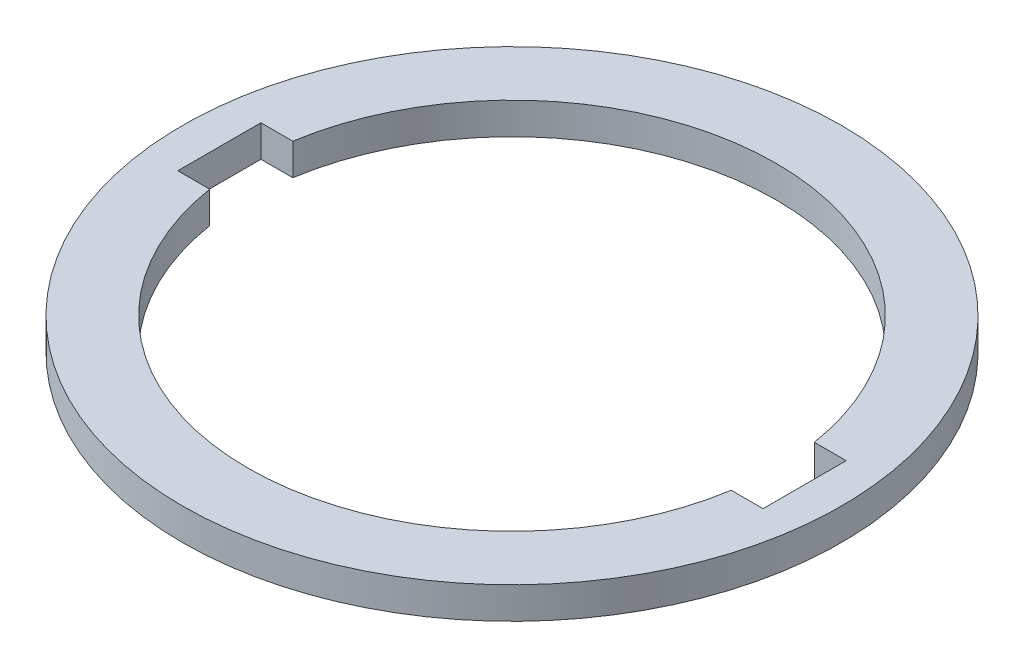
ISO-10303-21;
HEADER;
FILE_DESCRIPTION(('STEP AP214'),'2;1');
FILE_NAME('part.step','',(''),(''),'','','');
FILE_SCHEMA(('AUTOMOTIVE_DESIGN { 1 0 10303 214 1 1 1 1 }'));
ENDSEC;
DATA;
#1=APPLICATION_CONTEXT('core data for automotive mechanical design processes');
#2=APPLICATION_PROTOCOL_DEFINITION('international standard','automotive_design',2000,#1);
#3=PRODUCT_CONTEXT('',#1,'mechanical');
#4=PRODUCT('Part','Part','',(#3));
#5=PRODUCT_RELATED_PRODUCT_CATEGORY('part','',(#4));
#6=PRODUCT_DEFINITION_FORMATION('','',#4);
#7=PRODUCT_DEFINITION_CONTEXT('part definition',#1,'design');
#8=PRODUCT_DEFINITION('design','',#6,#7);
#9=PRODUCT_DEFINITION_SHAPE('','',#8);
#10=(LENGTH_UNIT() NAMED_UNIT(*) SI_UNIT(.MILLI.,.METRE.));
#11=(NAMED_UNIT(*) PLANE_ANGLE_UNIT() SI_UNIT($,.RADIAN.));
#12=(NAMED_UNIT(*) SI_UNIT($,.STERADIAN.) SOLID_ANGLE_UNIT());
#13=UNCERTAINTY_MEASURE_WITH_UNIT(LENGTH_MEASURE(1.E-05),#10,'distance_accuracy_value','');
#14=(GEOMETRIC_REPRESENTATION_CONTEXT(3) GLOBAL_UNCERTAINTY_ASSIGNED_CONTEXT((#13)) GLOBAL_UNIT_ASSIGNED_CONTEXT((#10,
#11,#12)) REPRESENTATION_CONTEXT('',''));
#15=CARTESIAN_POINT('',(0.,0.,0.));
#16=DIRECTION('',(0.,0.,1.));
#17=DIRECTION('',(1.,0.,0.));
#18=AXIS2_PLACEMENT_3D('',#15,#16,#17);
#19=CARTESIAN_POINT('',(0.,4.7625,0.));
#20=DIRECTION('',(0.,-1.,0.));
#21=DIRECTION('',(0.,0.,-1.));
#22=AXIS2_PLACEMENT_3D('',#19,#20,#21);
#23=CYLINDRICAL_SURFACE('',#22,39.7);
#24=DIRECTION('',(0.,-1.,0.));
#25=VECTOR('',#24,1.);
#26=CARTESIAN_POINT('',(-39.2049422904817,4.7625,6.25));
#27=LINE('',#26,#25);
#28=CARTESIAN_POINT('',(-39.2049422904817,4.7625,6.25));
#29=VERTEX_POINT('',#28);
#30=CARTESIAN_POINT('',(-39.2049422904817,0.,6.25));
#31=VERTEX_POINT('',#30);
#32=EDGE_CURVE('E12',#29,#31,#27,.T.);
#33=ORIENTED_EDGE('',*,*,#32,.F.);
#34=CARTESIAN_POINT('',(0.,4.7625,0.));
#35=DIRECTION('',(0.,1.,0.));
#36=DIRECTION('',(0.,0.,1.));
#37=AXIS2_PLACEMENT_3D('',#34,#35,#36);
#38=CIRCLE('',#37,39.7);
#39=CARTESIAN_POINT('',(39.2049422904817,4.7625,6.25));
#40=VERTEX_POINT('',#39);
#41=EDGE_CURVE('E166',#29,#40,#38,.T.);
#42=ORIENTED_EDGE('',*,*,#41,.T.);
#43=DIRECTION('',(0.,-1.,0.));
#44=VECTOR('',#43,1.);
#45=CARTESIAN_POINT('',(39.2049422904817,4.7625,6.25));
#46=LINE('',#45,#44);
#47=CARTESIAN_POINT('',(39.2049422904817,0.,6.25));
#48=VERTEX_POINT('',#47);
#49=EDGE_CURVE('E57',#48,#40,#46,.F.);
#50=ORIENTED_EDGE('',*,*,#49,.F.);
#51=CARTESIAN_POINT('',(0.,0.,0.));
#52=DIRECTION('',(0.,1.,0.));
#53=DIRECTION('',(0.,0.,1.));
#54=AXIS2_PLACEMENT_3D('',#51,#52,#53);
#55=CIRCLE('',#54,39.7);
#56=EDGE_CURVE('E159',#31,#48,#55,.T.);
#57=ORIENTED_EDGE('',*,*,#56,.F.);
#58=EDGE_LOOP('',(#33,#42,#50,#57));
#59=FACE_BOUND('',#58,.T.);
#60=ADVANCED_FACE('F47',(#59),#23,.F.);
#61=CARTESIAN_POINT('',(0.,4.7625,0.));
#62=DIRECTION('',(0.,1.,0.));
#63=DIRECTION('',(0.,0.,1.));
#64=AXIS2_PLACEMENT_3D('',#61,#62,#63);
#65=PLANE('',#64);
#66=DIRECTION('',(1.,0.,0.));
#67=VECTOR('',#66,1.);
#68=CARTESIAN_POINT('',(-44.,4.7625,6.25));
#69=LINE('',#68,#67);
#70=CARTESIAN_POINT('',(44.,4.7625,6.25));
#71=VERTEX_POINT('',#70);
#72=EDGE_CURVE('E145',#40,#71,#69,.T.);
#73=ORIENTED_EDGE('',*,*,#72,.F.);
#74=ORIENTED_EDGE('',*,*,#41,.F.);
#75=CARTESIAN_POINT('',(-44.,4.7625,6.25));
#76=VERTEX_POINT('',#75);
#77=EDGE_CURVE('E140',#76,#29,#69,.T.);
#78=ORIENTED_EDGE('',*,*,#77,.F.);
#79=DIRECTION('',(0.,0.,1.));
#80=VECTOR('',#79,1.);
#81=CARTESIAN_POINT('',(-44.,4.7625,6.25));
#82=LINE('',#81,#80);
#83=CARTESIAN_POINT('',(-44.,4.7625,-6.25));
#84=VERTEX_POINT('',#83);
#85=EDGE_CURVE('E281',#84,#76,#82,.T.);
#86=ORIENTED_EDGE('',*,*,#85,.F.);
#87=DIRECTION('',(-1.,0.,0.));
#88=VECTOR('',#87,1.);
#89=CARTESIAN_POINT('',(-44.,4.7625,-6.25));
#90=LINE('',#89,#88);
#91=CARTESIAN_POINT('',(-39.2049422904817,4.7625,-6.25));
#92=VERTEX_POINT('',#91);
#93=EDGE_CURVE('E359',#92,#84,#90,.T.);
#94=ORIENTED_EDGE('',*,*,#93,.F.);
#95=CARTESIAN_POINT('',(39.2049422904817,4.7625,-6.25));
#96=VERTEX_POINT('',#95);
#97=EDGE_CURVE('E284',#96,#92,#38,.T.);
#98=ORIENTED_EDGE('',*,*,#97,.F.);
#99=CARTESIAN_POINT('',(44.,4.7625,-6.25));
#100=VERTEX_POINT('',#99);
#101=EDGE_CURVE('E72',#100,#96,#90,.T.);
#102=ORIENTED_EDGE('',*,*,#101,.F.);
#103=DIRECTION('',(0.,0.,-1.));
#104=VECTOR('',#103,1.);
#105=CARTESIAN_POINT('',(44.,4.7625,6.25));
#106=LINE('',#105,#104);
#107=EDGE_CURVE('E121',#71,#100,#106,.T.);
#108=ORIENTED_EDGE('',*,*,#107,.F.);
#109=EDGE_LOOP('',(#73,#74,#78,#86,#94,#98,#102,#108));
#110=FACE_BOUND('',#109,.T.);
#111=CARTESIAN_POINT('',(0.,4.7625,0.));
#112=DIRECTION('',(0.,1.,0.));
#113=DIRECTION('',(0.,0.,1.));
#114=AXIS2_PLACEMENT_3D('',#111,#112,#113);
#115=CIRCLE('',#114,49.55);
#116=CARTESIAN_POINT('',(0.,4.7625,49.55));
#117=VERTEX_POINT('',#116);
#118=EDGE_CURVE('E168',#117,#117,#115,.T.);
#119=ORIENTED_EDGE('',*,*,#118,.T.);
#120=EDGE_LOOP('',(#119));
#121=FACE_BOUND('',#120,.T.);
#122=ADVANCED_FACE('F277',(#110,#121),#65,.T.);
#123=CARTESIAN_POINT('',(0.,0.,0.));
#124=DIRECTION('',(0.,1.,0.));
#125=DIRECTION('',(0.,0.,1.));
#126=AXIS2_PLACEMENT_3D('',#123,#124,#125);
#127=PLANE('',#126);
#128=CARTESIAN_POINT('',(0.,0.,0.));
#129=DIRECTION('',(0.,1.,0.));
#130=DIRECTION('',(0.,0.,1.));
#131=AXIS2_PLACEMENT_3D('',#128,#129,#130);
#132=CIRCLE('',#131,49.55);
#133=CARTESIAN_POINT('',(0.,0.,49.55));
#134=VERTEX_POINT('',#133);
#135=EDGE_CURVE('E287',#134,#134,#132,.T.);
#136=ORIENTED_EDGE('',*,*,#135,.F.);
#137=EDGE_LOOP('',(#136));
#138=FACE_BOUND('',#137,.T.);
#139=ORIENTED_EDGE('',*,*,#56,.T.);
#140=DIRECTION('',(1.,0.,0.));
#141=VECTOR('',#140,1.);
#142=CARTESIAN_POINT('',(-44.,0.,6.25));
#143=LINE('',#142,#141);
#144=CARTESIAN_POINT('',(44.,0.,6.25));
#145=VERTEX_POINT('',#144);
#146=EDGE_CURVE('E138',#48,#145,#143,.T.);
#147=ORIENTED_EDGE('',*,*,#146,.T.);
#148=DIRECTION('',(0.,0.,-1.));
#149=VECTOR('',#148,1.);
#150=CARTESIAN_POINT('',(44.,0.,6.25));
#151=LINE('',#150,#149);
#152=CARTESIAN_POINT('',(44.,0.,-6.25));
#153=VERTEX_POINT('',#152);
#154=EDGE_CURVE('E118',#145,#153,#151,.T.);
#155=ORIENTED_EDGE('',*,*,#154,.T.);
#156=DIRECTION('',(-1.,0.,0.));
#157=VECTOR('',#156,1.);
#158=CARTESIAN_POINT('',(-44.,0.,-6.25));
#159=LINE('',#158,#157);
#160=CARTESIAN_POINT('',(39.2049422904817,0.,-6.25));
#161=VERTEX_POINT('',#160);
#162=EDGE_CURVE('E127',#153,#161,#159,.T.);
#163=ORIENTED_EDGE('',*,*,#162,.T.);
#164=CARTESIAN_POINT('',(-39.2049422904817,0.,-6.25));
#165=VERTEX_POINT('',#164);
#166=EDGE_CURVE('E164',#161,#165,#55,.T.);
#167=ORIENTED_EDGE('',*,*,#166,.T.);
#168=CARTESIAN_POINT('',(-44.,0.,-6.25));
#169=VERTEX_POINT('',#168);
#170=EDGE_CURVE('E64',#165,#169,#159,.T.);
#171=ORIENTED_EDGE('',*,*,#170,.T.);
#172=DIRECTION('',(0.,0.,1.));
#173=VECTOR('',#172,1.);
#174=CARTESIAN_POINT('',(-44.,0.,6.25));
#175=LINE('',#174,#173);
#176=CARTESIAN_POINT('',(-44.,0.,6.25));
#177=VERTEX_POINT('',#176);
#178=EDGE_CURVE('E134',#169,#177,#175,.T.);
#179=ORIENTED_EDGE('',*,*,#178,.T.);
#180=EDGE_CURVE('E124',#177,#31,#143,.T.);
#181=ORIENTED_EDGE('',*,*,#180,.T.);
#182=EDGE_LOOP('',(#139,#147,#155,#163,#167,#171,#179,#181));
#183=FACE_BOUND('',#182,.T.);
#184=ADVANCED_FACE('F137',(#138,#183),#127,.F.);
#185=CARTESIAN_POINT('',(0.,4.7625,0.));
#186=DIRECTION('',(0.,-1.,0.));
#187=DIRECTION('',(0.,0.,-1.));
#188=AXIS2_PLACEMENT_3D('',#185,#186,#187);
#189=CYLINDRICAL_SURFACE('',#188,49.55);
#190=ORIENTED_EDGE('',*,*,#118,.F.);
#191=EDGE_LOOP('',(#190));
#192=FACE_BOUND('',#191,.T.);
#193=ORIENTED_EDGE('',*,*,#135,.T.);
#194=EDGE_LOOP('',(#193));
#195=FACE_BOUND('',#194,.T.);
#196=ADVANCED_FACE('F49',(#192,#195),#189,.T.);
#197=DIRECTION('',(0.,-1.,0.));
#198=VECTOR('',#197,1.);
#199=CARTESIAN_POINT('',(39.2049422904817,4.7625,-6.25));
#200=LINE('',#199,#198);
#201=EDGE_CURVE('E129',#96,#161,#200,.T.);
#202=ORIENTED_EDGE('',*,*,#201,.F.);
#203=ORIENTED_EDGE('',*,*,#97,.T.);
#204=DIRECTION('',(0.,-1.,0.));
#205=VECTOR('',#204,1.);
#206=CARTESIAN_POINT('',(-39.2049422904817,4.7625,-6.25));
#207=LINE('',#206,#205);
#208=EDGE_CURVE('E265',#165,#92,#207,.F.);
#209=ORIENTED_EDGE('',*,*,#208,.F.);
#210=ORIENTED_EDGE('',*,*,#166,.F.);
#211=EDGE_LOOP('',(#202,#203,#209,#210));
#212=FACE_BOUND('',#211,.T.);
#213=ADVANCED_FACE('F291',(#212),#23,.F.);
#214=CARTESIAN_POINT('',(-44.,0.,6.25));
#215=DIRECTION('',(0.,0.,1.));
#216=DIRECTION('',(1.,0.,0.));
#217=AXIS2_PLACEMENT_3D('',#214,#215,#216);
#218=PLANE('',#217);
#219=ORIENTED_EDGE('',*,*,#32,.T.);
#220=ORIENTED_EDGE('',*,*,#180,.F.);
#221=DIRECTION('',(0.,1.,0.));
#222=VECTOR('',#221,1.);
#223=CARTESIAN_POINT('',(-44.,0.,6.25));
#224=LINE('',#223,#222);
#225=EDGE_CURVE('E182',#177,#76,#224,.T.);
#226=ORIENTED_EDGE('',*,*,#225,.T.);
#227=ORIENTED_EDGE('',*,*,#77,.T.);
#228=EDGE_LOOP('',(#219,#220,#226,#227));
#229=FACE_BOUND('',#228,.T.);
#230=ADVANCED_FACE('F319',(#229),#218,.F.);
#231=CARTESIAN_POINT('',(-44.,0.,-6.25));
#232=DIRECTION('',(0.,0.,-1.));
#233=DIRECTION('',(-1.,0.,0.));
#234=AXIS2_PLACEMENT_3D('',#231,#232,#233);
#235=PLANE('',#234);
#236=ORIENTED_EDGE('',*,*,#208,.T.);
#237=ORIENTED_EDGE('',*,*,#93,.T.);
#238=DIRECTION('',(0.,1.,0.));
#239=VECTOR('',#238,1.);
#240=CARTESIAN_POINT('',(-44.,0.,-6.25));
#241=LINE('',#240,#239);
#242=EDGE_CURVE('E123',#169,#84,#241,.T.);
#243=ORIENTED_EDGE('',*,*,#242,.F.);
#244=ORIENTED_EDGE('',*,*,#170,.F.);
#245=EDGE_LOOP('',(#236,#237,#243,#244));
#246=FACE_BOUND('',#245,.T.);
#247=ADVANCED_FACE('F323',(#246),#235,.F.);
#248=CARTESIAN_POINT('',(-44.,0.,6.25));
#249=DIRECTION('',(-1.,0.,0.));
#250=DIRECTION('',(0.,0.,1.));
#251=AXIS2_PLACEMENT_3D('',#248,#249,#250);
#252=PLANE('',#251);
#253=ORIENTED_EDGE('',*,*,#85,.T.);
#254=ORIENTED_EDGE('',*,*,#225,.F.);
#255=ORIENTED_EDGE('',*,*,#178,.F.);
#256=ORIENTED_EDGE('',*,*,#242,.T.);
#257=EDGE_LOOP('',(#253,#254,#255,#256));
#258=FACE_BOUND('',#257,.T.);
#259=ADVANCED_FACE('F329',(#258),#252,.F.);
#260=ORIENTED_EDGE('',*,*,#201,.T.);
#261=ORIENTED_EDGE('',*,*,#162,.F.);
#262=DIRECTION('',(0.,1.,0.));
#263=VECTOR('',#262,1.);
#264=CARTESIAN_POINT('',(44.,0.,-6.25));
#265=LINE('',#264,#263);
#266=EDGE_CURVE('E113',#153,#100,#265,.T.);
#267=ORIENTED_EDGE('',*,*,#266,.T.);
#268=ORIENTED_EDGE('',*,*,#101,.T.);
#269=EDGE_LOOP('',(#260,#261,#267,#268));
#270=FACE_BOUND('',#269,.T.);
#271=ADVANCED_FACE('F128',(#270),#235,.F.);
#272=CARTESIAN_POINT('',(44.,0.,6.25));
#273=DIRECTION('',(1.,0.,0.));
#274=DIRECTION('',(0.,0.,-1.));
#275=AXIS2_PLACEMENT_3D('',#272,#273,#274);
#276=PLANE('',#275);
#277=ORIENTED_EDGE('',*,*,#107,.T.);
#278=ORIENTED_EDGE('',*,*,#266,.F.);
#279=ORIENTED_EDGE('',*,*,#154,.F.);
#280=DIRECTION('',(0.,1.,0.));
#281=VECTOR('',#280,1.);
#282=CARTESIAN_POINT('',(44.,0.,6.25));
#283=LINE('',#282,#281);
#284=EDGE_CURVE('E165',#145,#71,#283,.T.);
#285=ORIENTED_EDGE('',*,*,#284,.T.);
#286=EDGE_LOOP('',(#277,#278,#279,#285));
#287=FACE_BOUND('',#286,.T.);
#288=ADVANCED_FACE('F115',(#287),#276,.F.);
#289=ORIENTED_EDGE('',*,*,#49,.T.);
#290=ORIENTED_EDGE('',*,*,#72,.T.);
#291=ORIENTED_EDGE('',*,*,#284,.F.);
#292=ORIENTED_EDGE('',*,*,#146,.F.);
#293=EDGE_LOOP('',(#289,#290,#291,#292));
#294=FACE_BOUND('',#293,.T.);
#295=ADVANCED_FACE('F270',(#294),#218,.F.);
#296=CLOSED_SHELL('',(#60,#122,#184,#196,#213,#230,#247,#259,#271,#288,#295));
#297=MANIFOLD_SOLID_BREP('B2',#296);
#298=ADVANCED_BREP_SHAPE_REPRESENTATION('',(#18,#297),#14);
#299=SHAPE_DEFINITION_REPRESENTATION(#9,#298);
ENDSEC;
END-ISO-10303-21;
